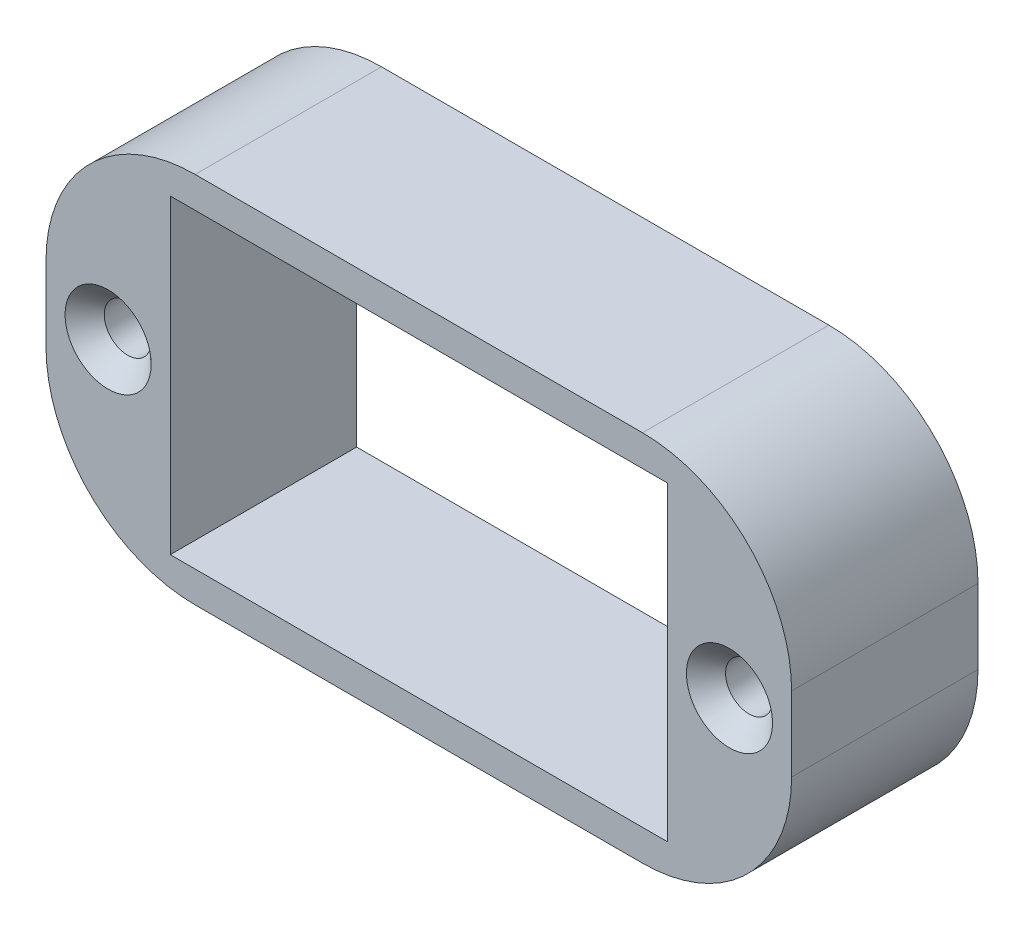
ISO-10303-21;
HEADER;
FILE_DESCRIPTION(('STEP AP214'),'2;1');
FILE_NAME('part.step','',(''),(''),'','','');
FILE_SCHEMA(('AUTOMOTIVE_DESIGN { 1 0 10303 214 1 1 1 1 }'));
ENDSEC;
DATA;
#1=APPLICATION_CONTEXT('core data for automotive mechanical design processes');
#2=APPLICATION_PROTOCOL_DEFINITION('international standard','automotive_design',2000,#1);
#3=PRODUCT_CONTEXT('',#1,'mechanical');
#4=PRODUCT('Part','Part','',(#3));
#5=PRODUCT_RELATED_PRODUCT_CATEGORY('part','',(#4));
#6=PRODUCT_DEFINITION_FORMATION('','',#4);
#7=PRODUCT_DEFINITION_CONTEXT('part definition',#1,'design');
#8=PRODUCT_DEFINITION('design','',#6,#7);
#9=PRODUCT_DEFINITION_SHAPE('','',#8);
#10=(LENGTH_UNIT() NAMED_UNIT(*) SI_UNIT(.MILLI.,.METRE.));
#11=(NAMED_UNIT(*) PLANE_ANGLE_UNIT() SI_UNIT($,.RADIAN.));
#12=(NAMED_UNIT(*) SI_UNIT($,.STERADIAN.) SOLID_ANGLE_UNIT());
#13=UNCERTAINTY_MEASURE_WITH_UNIT(LENGTH_MEASURE(1.E-05),#10,'distance_accuracy_value','');
#14=(GEOMETRIC_REPRESENTATION_CONTEXT(3) GLOBAL_UNCERTAINTY_ASSIGNED_CONTEXT((#13)) GLOBAL_UNIT_ASSIGNED_CONTEXT((#10,
#11,#12)) REPRESENTATION_CONTEXT('',''));
#15=CARTESIAN_POINT('',(0.,0.,0.));
#16=DIRECTION('',(0.,0.,1.));
#17=DIRECTION('',(1.,0.,0.));
#18=AXIS2_PLACEMENT_3D('',#15,#16,#17);
#19=CARTESIAN_POINT('',(-19.05,-9.525,9.525));
#20=DIRECTION('',(1.,0.,0.));
#21=DIRECTION('',(0.,0.,-1.));
#22=AXIS2_PLACEMENT_3D('',#19,#20,#21);
#23=PLANE('',#22);
#24=DIRECTION('',(0.,-1.,0.));
#25=VECTOR('',#24,1.);
#26=CARTESIAN_POINT('',(-19.05,-9.525,0.));
#27=LINE('',#26,#25);
#28=CARTESIAN_POINT('',(-19.05,1.905,0.));
#29=VERTEX_POINT('',#28);
#30=CARTESIAN_POINT('',(-19.05,-1.905,0.));
#31=VERTEX_POINT('',#30);
#32=EDGE_CURVE('E168',#29,#31,#27,.T.);
#33=ORIENTED_EDGE('',*,*,#32,.T.);
#34=DIRECTION('',(0.,0.,-1.));
#35=VECTOR('',#34,1.);
#36=CARTESIAN_POINT('',(-19.05,-1.905,9.525));
#37=LINE('',#36,#35);
#38=CARTESIAN_POINT('',(-19.05,-1.905,9.525));
#39=VERTEX_POINT('',#38);
#40=EDGE_CURVE('E11',#31,#39,#37,.F.);
#41=ORIENTED_EDGE('',*,*,#40,.T.);
#42=DIRECTION('',(0.,-1.,0.));
#43=VECTOR('',#42,1.);
#44=CARTESIAN_POINT('',(-19.05,-9.525,9.525));
#45=LINE('',#44,#43);
#46=CARTESIAN_POINT('',(-19.05,1.905,9.525));
#47=VERTEX_POINT('',#46);
#48=EDGE_CURVE('E172',#47,#39,#45,.T.);
#49=ORIENTED_EDGE('',*,*,#48,.F.);
#50=DIRECTION('',(0.,0.,-1.));
#51=VECTOR('',#50,1.);
#52=CARTESIAN_POINT('',(-19.05,1.905,9.525));
#53=LINE('',#52,#51);
#54=EDGE_CURVE('E43',#47,#29,#53,.T.);
#55=ORIENTED_EDGE('',*,*,#54,.T.);
#56=EDGE_LOOP('',(#33,#41,#49,#55));
#57=FACE_BOUND('',#56,.T.);
#58=ADVANCED_FACE('F35',(#57),#23,.F.);
#59=CARTESIAN_POINT('',(19.05,-9.525,9.525));
#60=DIRECTION('',(0.,1.,0.));
#61=DIRECTION('',(-1.,0.,0.));
#62=AXIS2_PLACEMENT_3D('',#59,#60,#61);
#63=PLANE('',#62);
#64=DIRECTION('',(1.,0.,0.));
#65=VECTOR('',#64,1.);
#66=CARTESIAN_POINT('',(19.05,-9.525,0.));
#67=LINE('',#66,#65);
#68=CARTESIAN_POINT('',(-11.43,-9.525,0.));
#69=VERTEX_POINT('',#68);
#70=CARTESIAN_POINT('',(11.43,-9.525,0.));
#71=VERTEX_POINT('',#70);
#72=EDGE_CURVE('E186',#69,#71,#67,.T.);
#73=ORIENTED_EDGE('',*,*,#72,.T.);
#74=DIRECTION('',(0.,0.,-1.));
#75=VECTOR('',#74,1.);
#76=CARTESIAN_POINT('',(11.43,-9.525,9.525));
#77=LINE('',#76,#75);
#78=CARTESIAN_POINT('',(11.43,-9.525,9.525));
#79=VERTEX_POINT('',#78);
#80=EDGE_CURVE('E50',#71,#79,#77,.F.);
#81=ORIENTED_EDGE('',*,*,#80,.T.);
#82=DIRECTION('',(1.,0.,0.));
#83=VECTOR('',#82,1.);
#84=CARTESIAN_POINT('',(19.05,-9.525,9.525));
#85=LINE('',#84,#83);
#86=CARTESIAN_POINT('',(-11.43,-9.525,9.525));
#87=VERTEX_POINT('',#86);
#88=EDGE_CURVE('E174',#87,#79,#85,.T.);
#89=ORIENTED_EDGE('',*,*,#88,.F.);
#90=DIRECTION('',(0.,0.,-1.));
#91=VECTOR('',#90,1.);
#92=CARTESIAN_POINT('',(-11.43,-9.525,9.525));
#93=LINE('',#92,#91);
#94=EDGE_CURVE('E217',#87,#69,#93,.T.);
#95=ORIENTED_EDGE('',*,*,#94,.T.);
#96=EDGE_LOOP('',(#73,#81,#89,#95));
#97=FACE_BOUND('',#96,.T.);
#98=ADVANCED_FACE('F233',(#97),#63,.F.);
#99=CARTESIAN_POINT('',(19.05,-9.525,9.525));
#100=DIRECTION('',(-1.,0.,0.));
#101=DIRECTION('',(0.,0.,1.));
#102=AXIS2_PLACEMENT_3D('',#99,#100,#101);
#103=PLANE('',#102);
#104=DIRECTION('',(0.,1.,0.));
#105=VECTOR('',#104,1.);
#106=CARTESIAN_POINT('',(19.05,-9.525,0.));
#107=LINE('',#106,#105);
#108=CARTESIAN_POINT('',(19.05,-1.905,0.));
#109=VERTEX_POINT('',#108);
#110=CARTESIAN_POINT('',(19.05,1.905,0.));
#111=VERTEX_POINT('',#110);
#112=EDGE_CURVE('E188',#109,#111,#107,.T.);
#113=ORIENTED_EDGE('',*,*,#112,.T.);
#114=DIRECTION('',(0.,0.,-1.));
#115=VECTOR('',#114,1.);
#116=CARTESIAN_POINT('',(19.05,1.905,9.525));
#117=LINE('',#116,#115);
#118=CARTESIAN_POINT('',(19.05,1.905,9.525));
#119=VERTEX_POINT('',#118);
#120=EDGE_CURVE('E208',#111,#119,#117,.F.);
#121=ORIENTED_EDGE('',*,*,#120,.T.);
#122=DIRECTION('',(0.,1.,0.));
#123=VECTOR('',#122,1.);
#124=CARTESIAN_POINT('',(19.05,-9.525,9.525));
#125=LINE('',#124,#123);
#126=CARTESIAN_POINT('',(19.05,-1.905,9.525));
#127=VERTEX_POINT('',#126);
#128=EDGE_CURVE('E177',#127,#119,#125,.T.);
#129=ORIENTED_EDGE('',*,*,#128,.F.);
#130=DIRECTION('',(0.,0.,-1.));
#131=VECTOR('',#130,1.);
#132=CARTESIAN_POINT('',(19.05,-1.905,9.525));
#133=LINE('',#132,#131);
#134=EDGE_CURVE('E205',#127,#109,#133,.T.);
#135=ORIENTED_EDGE('',*,*,#134,.T.);
#136=EDGE_LOOP('',(#113,#121,#129,#135));
#137=FACE_BOUND('',#136,.T.);
#138=ADVANCED_FACE('F242',(#137),#103,.F.);
#139=CARTESIAN_POINT('',(19.05,9.525,9.525));
#140=DIRECTION('',(0.,-1.,0.));
#141=DIRECTION('',(1.,0.,0.));
#142=AXIS2_PLACEMENT_3D('',#139,#140,#141);
#143=PLANE('',#142);
#144=DIRECTION('',(-1.,0.,0.));
#145=VECTOR('',#144,1.);
#146=CARTESIAN_POINT('',(19.05,9.525,9.525));
#147=LINE('',#146,#145);
#148=CARTESIAN_POINT('',(11.43,9.525,9.525));
#149=VERTEX_POINT('',#148);
#150=CARTESIAN_POINT('',(-11.43,9.525,9.525));
#151=VERTEX_POINT('',#150);
#152=EDGE_CURVE('E180',#149,#151,#147,.T.);
#153=ORIENTED_EDGE('',*,*,#152,.F.);
#154=DIRECTION('',(0.,0.,-1.));
#155=VECTOR('',#154,1.);
#156=CARTESIAN_POINT('',(11.43,9.525,9.525));
#157=LINE('',#156,#155);
#158=CARTESIAN_POINT('',(11.43,9.525,0.));
#159=VERTEX_POINT('',#158);
#160=EDGE_CURVE('E194',#149,#159,#157,.T.);
#161=ORIENTED_EDGE('',*,*,#160,.T.);
#162=DIRECTION('',(-1.,0.,0.));
#163=VECTOR('',#162,1.);
#164=CARTESIAN_POINT('',(19.05,9.525,0.));
#165=LINE('',#164,#163);
#166=CARTESIAN_POINT('',(-11.43,9.525,0.));
#167=VERTEX_POINT('',#166);
#168=EDGE_CURVE('E175',#159,#167,#165,.T.);
#169=ORIENTED_EDGE('',*,*,#168,.T.);
#170=DIRECTION('',(0.,0.,-1.));
#171=VECTOR('',#170,1.);
#172=CARTESIAN_POINT('',(-11.43,9.525,9.525));
#173=LINE('',#172,#171);
#174=EDGE_CURVE('E183',#167,#151,#173,.F.);
#175=ORIENTED_EDGE('',*,*,#174,.T.);
#176=EDGE_LOOP('',(#153,#161,#169,#175));
#177=FACE_BOUND('',#176,.T.);
#178=ADVANCED_FACE('F250',(#177),#143,.F.);
#179=CARTESIAN_POINT('',(0.,0.,9.525));
#180=DIRECTION('',(0.,0.,1.));
#181=DIRECTION('',(1.,0.,0.));
#182=AXIS2_PLACEMENT_3D('',#179,#180,#181);
#183=PLANE('',#182);
#184=CARTESIAN_POINT('',(-15.875,0.,9.525));
#185=DIRECTION('',(0.,0.,1.));
#186=DIRECTION('',(1.,0.,0.));
#187=AXIS2_PLACEMENT_3D('',#184,#185,#186);
#188=CIRCLE('',#187,2.2);
#189=CARTESIAN_POINT('',(-13.675,0.,9.525));
#190=VERTEX_POINT('',#189);
#191=EDGE_CURVE('E419',#190,#190,#188,.T.);
#192=ORIENTED_EDGE('',*,*,#191,.F.);
#193=EDGE_LOOP('',(#192));
#194=FACE_BOUND('',#193,.T.);
#195=CARTESIAN_POINT('',(15.875,0.,9.525));
#196=DIRECTION('',(0.,0.,1.));
#197=DIRECTION('',(1.,0.,0.));
#198=AXIS2_PLACEMENT_3D('',#195,#196,#197);
#199=CIRCLE('',#198,2.2);
#200=CARTESIAN_POINT('',(18.075,0.,9.525));
#201=VERTEX_POINT('',#200);
#202=EDGE_CURVE('E426',#201,#201,#199,.T.);
#203=ORIENTED_EDGE('',*,*,#202,.F.);
#204=EDGE_LOOP('',(#203));
#205=FACE_BOUND('',#204,.T.);
#206=DIRECTION('',(0.,-1.,0.));
#207=VECTOR('',#206,1.);
#208=CARTESIAN_POINT('',(-12.7,-7.9375,9.525));
#209=LINE('',#208,#207);
#210=CARTESIAN_POINT('',(-12.7,7.9375,9.525));
#211=VERTEX_POINT('',#210);
#212=CARTESIAN_POINT('',(-12.7,-7.9375,9.525));
#213=VERTEX_POINT('',#212);
#214=EDGE_CURVE('E132',#211,#213,#209,.T.);
#215=ORIENTED_EDGE('',*,*,#214,.F.);
#216=DIRECTION('',(-1.,0.,0.));
#217=VECTOR('',#216,1.);
#218=CARTESIAN_POINT('',(12.7,7.93750000000001,9.525));
#219=LINE('',#218,#217);
#220=CARTESIAN_POINT('',(12.7,7.93750000000001,9.525));
#221=VERTEX_POINT('',#220);
#222=EDGE_CURVE('E150',#221,#211,#219,.T.);
#223=ORIENTED_EDGE('',*,*,#222,.F.);
#224=DIRECTION('',(0.,1.,0.));
#225=VECTOR('',#224,1.);
#226=CARTESIAN_POINT('',(12.7,-7.9375,9.525));
#227=LINE('',#226,#225);
#228=CARTESIAN_POINT('',(12.7,-7.9375,9.525));
#229=VERTEX_POINT('',#228);
#230=EDGE_CURVE('E153',#229,#221,#227,.T.);
#231=ORIENTED_EDGE('',*,*,#230,.F.);
#232=DIRECTION('',(1.,0.,0.));
#233=VECTOR('',#232,1.);
#234=CARTESIAN_POINT('',(12.7,-7.9375,9.525));
#235=LINE('',#234,#233);
#236=EDGE_CURVE('E162',#213,#229,#235,.T.);
#237=ORIENTED_EDGE('',*,*,#236,.F.);
#238=EDGE_LOOP('',(#215,#223,#231,#237));
#239=FACE_BOUND('',#238,.T.);
#240=ORIENTED_EDGE('',*,*,#128,.T.);
#241=CARTESIAN_POINT('',(11.43,1.905,9.525));
#242=DIRECTION('',(0.,0.,1.));
#243=DIRECTION('',(1.,0.,0.));
#244=AXIS2_PLACEMENT_3D('',#241,#242,#243);
#245=CIRCLE('',#244,7.62);
#246=EDGE_CURVE('E215',#119,#149,#245,.T.);
#247=ORIENTED_EDGE('',*,*,#246,.T.);
#248=ORIENTED_EDGE('',*,*,#152,.T.);
#249=CARTESIAN_POINT('',(-11.43,1.905,9.525));
#250=DIRECTION('',(0.,0.,1.));
#251=DIRECTION('',(1.,0.,0.));
#252=AXIS2_PLACEMENT_3D('',#249,#250,#251);
#253=CIRCLE('',#252,7.62);
#254=EDGE_CURVE('E210',#151,#47,#253,.T.);
#255=ORIENTED_EDGE('',*,*,#254,.T.);
#256=ORIENTED_EDGE('',*,*,#48,.T.);
#257=CARTESIAN_POINT('',(-11.43,-1.905,9.525));
#258=DIRECTION('',(0.,0.,1.));
#259=DIRECTION('',(1.,0.,0.));
#260=AXIS2_PLACEMENT_3D('',#257,#258,#259);
#261=CIRCLE('',#260,7.62);
#262=EDGE_CURVE('E57',#39,#87,#261,.T.);
#263=ORIENTED_EDGE('',*,*,#262,.T.);
#264=ORIENTED_EDGE('',*,*,#88,.T.);
#265=CARTESIAN_POINT('',(11.43,-1.905,9.525));
#266=DIRECTION('',(0.,0.,1.));
#267=DIRECTION('',(1.,0.,0.));
#268=AXIS2_PLACEMENT_3D('',#265,#266,#267);
#269=CIRCLE('',#268,7.62);
#270=EDGE_CURVE('E213',#79,#127,#269,.T.);
#271=ORIENTED_EDGE('',*,*,#270,.T.);
#272=EDGE_LOOP('',(#240,#247,#248,#255,#256,#263,#264,#271));
#273=FACE_BOUND('',#272,.T.);
#274=ADVANCED_FACE('F235',(#194,#205,#239,#273),#183,.T.);
#275=CARTESIAN_POINT('',(0.,0.,0.));
#276=DIRECTION('',(0.,0.,1.));
#277=DIRECTION('',(1.,0.,0.));
#278=AXIS2_PLACEMENT_3D('',#275,#276,#277);
#279=PLANE('',#278);
#280=CARTESIAN_POINT('',(-15.875,0.,0.));
#281=DIRECTION('',(0.,0.,1.));
#282=DIRECTION('',(1.,0.,0.));
#283=AXIS2_PLACEMENT_3D('',#280,#281,#282);
#284=CIRCLE('',#283,1.2);
#285=CARTESIAN_POINT('',(-14.675,0.,0.));
#286=VERTEX_POINT('',#285);
#287=EDGE_CURVE('E421',#286,#286,#284,.T.);
#288=ORIENTED_EDGE('',*,*,#287,.T.);
#289=EDGE_LOOP('',(#288));
#290=FACE_BOUND('',#289,.T.);
#291=CARTESIAN_POINT('',(15.875,0.,0.));
#292=DIRECTION('',(0.,0.,1.));
#293=DIRECTION('',(1.,0.,0.));
#294=AXIS2_PLACEMENT_3D('',#291,#292,#293);
#295=CIRCLE('',#294,1.2);
#296=CARTESIAN_POINT('',(17.075,0.,0.));
#297=VERTEX_POINT('',#296);
#298=EDGE_CURVE('E156',#297,#297,#295,.T.);
#299=ORIENTED_EDGE('',*,*,#298,.T.);
#300=EDGE_LOOP('',(#299));
#301=FACE_BOUND('',#300,.T.);
#302=DIRECTION('',(-1.,0.,0.));
#303=VECTOR('',#302,1.);
#304=CARTESIAN_POINT('',(12.7,7.93750000000001,0.));
#305=LINE('',#304,#303);
#306=CARTESIAN_POINT('',(12.7,7.93750000000001,0.));
#307=VERTEX_POINT('',#306);
#308=CARTESIAN_POINT('',(-12.7,7.9375,0.));
#309=VERTEX_POINT('',#308);
#310=EDGE_CURVE('E137',#307,#309,#305,.T.);
#311=ORIENTED_EDGE('',*,*,#310,.T.);
#312=DIRECTION('',(0.,-1.,0.));
#313=VECTOR('',#312,1.);
#314=CARTESIAN_POINT('',(-12.7,-7.9375,0.));
#315=LINE('',#314,#313);
#316=CARTESIAN_POINT('',(-12.7,-7.9375,0.));
#317=VERTEX_POINT('',#316);
#318=EDGE_CURVE('E129',#309,#317,#315,.T.);
#319=ORIENTED_EDGE('',*,*,#318,.T.);
#320=DIRECTION('',(1.,0.,0.));
#321=VECTOR('',#320,1.);
#322=CARTESIAN_POINT('',(12.7,-7.9375,0.));
#323=LINE('',#322,#321);
#324=CARTESIAN_POINT('',(12.7,-7.9375,0.));
#325=VERTEX_POINT('',#324);
#326=EDGE_CURVE('E141',#317,#325,#323,.T.);
#327=ORIENTED_EDGE('',*,*,#326,.T.);
#328=DIRECTION('',(0.,1.,0.));
#329=VECTOR('',#328,1.);
#330=CARTESIAN_POINT('',(12.7,-7.9375,0.));
#331=LINE('',#330,#329);
#332=EDGE_CURVE('E145',#325,#307,#331,.T.);
#333=ORIENTED_EDGE('',*,*,#332,.T.);
#334=EDGE_LOOP('',(#311,#319,#327,#333));
#335=FACE_BOUND('',#334,.T.);
#336=ORIENTED_EDGE('',*,*,#168,.F.);
#337=CARTESIAN_POINT('',(11.43,1.905,0.));
#338=DIRECTION('',(0.,0.,1.));
#339=DIRECTION('',(1.,0.,0.));
#340=AXIS2_PLACEMENT_3D('',#337,#338,#339);
#341=CIRCLE('',#340,7.62);
#342=EDGE_CURVE('E203',#159,#111,#341,.F.);
#343=ORIENTED_EDGE('',*,*,#342,.T.);
#344=ORIENTED_EDGE('',*,*,#112,.F.);
#345=CARTESIAN_POINT('',(11.43,-1.905,0.));
#346=DIRECTION('',(0.,0.,1.));
#347=DIRECTION('',(1.,0.,0.));
#348=AXIS2_PLACEMENT_3D('',#345,#346,#347);
#349=CIRCLE('',#348,7.62);
#350=EDGE_CURVE('E201',#109,#71,#349,.F.);
#351=ORIENTED_EDGE('',*,*,#350,.T.);
#352=ORIENTED_EDGE('',*,*,#72,.F.);
#353=CARTESIAN_POINT('',(-11.43,-1.905,0.));
#354=DIRECTION('',(0.,0.,1.));
#355=DIRECTION('',(1.,0.,0.));
#356=AXIS2_PLACEMENT_3D('',#353,#354,#355);
#357=CIRCLE('',#356,7.62);
#358=EDGE_CURVE('E199',#69,#31,#357,.F.);
#359=ORIENTED_EDGE('',*,*,#358,.T.);
#360=ORIENTED_EDGE('',*,*,#32,.F.);
#361=CARTESIAN_POINT('',(-11.43,1.905,0.));
#362=DIRECTION('',(0.,0.,1.));
#363=DIRECTION('',(1.,0.,0.));
#364=AXIS2_PLACEMENT_3D('',#361,#362,#363);
#365=CIRCLE('',#364,7.62);
#366=EDGE_CURVE('E197',#29,#167,#365,.F.);
#367=ORIENTED_EDGE('',*,*,#366,.T.);
#368=EDGE_LOOP('',(#336,#343,#344,#351,#352,#359,#360,#367));
#369=FACE_BOUND('',#368,.T.);
#370=ADVANCED_FACE('F147',(#290,#301,#335,#369),#279,.F.);
#371=CARTESIAN_POINT('',(-12.7,-7.9375,0.));
#372=DIRECTION('',(-1.,0.,0.));
#373=DIRECTION('',(0.,0.,1.));
#374=AXIS2_PLACEMENT_3D('',#371,#372,#373);
#375=PLANE('',#374);
#376=ORIENTED_EDGE('',*,*,#214,.T.);
#377=DIRECTION('',(0.,0.,1.));
#378=VECTOR('',#377,1.);
#379=CARTESIAN_POINT('',(-12.7,-7.9375,0.));
#380=LINE('',#379,#378);
#381=EDGE_CURVE('E125',#317,#213,#380,.T.);
#382=ORIENTED_EDGE('',*,*,#381,.F.);
#383=ORIENTED_EDGE('',*,*,#318,.F.);
#384=DIRECTION('',(0.,0.,1.));
#385=VECTOR('',#384,1.);
#386=CARTESIAN_POINT('',(-12.7,7.9375,0.));
#387=LINE('',#386,#385);
#388=EDGE_CURVE('E166',#309,#211,#387,.T.);
#389=ORIENTED_EDGE('',*,*,#388,.T.);
#390=EDGE_LOOP('',(#376,#382,#383,#389));
#391=FACE_BOUND('',#390,.T.);
#392=ADVANCED_FACE('F127',(#391),#375,.F.);
#393=CARTESIAN_POINT('',(12.7,7.93750000000001,0.));
#394=DIRECTION('',(0.,1.,0.));
#395=DIRECTION('',(-1.,0.,0.));
#396=AXIS2_PLACEMENT_3D('',#393,#394,#395);
#397=PLANE('',#396);
#398=ORIENTED_EDGE('',*,*,#222,.T.);
#399=ORIENTED_EDGE('',*,*,#388,.F.);
#400=ORIENTED_EDGE('',*,*,#310,.F.);
#401=DIRECTION('',(0.,0.,1.));
#402=VECTOR('',#401,1.);
#403=CARTESIAN_POINT('',(12.7,7.93750000000001,0.));
#404=LINE('',#403,#402);
#405=EDGE_CURVE('E169',#307,#221,#404,.T.);
#406=ORIENTED_EDGE('',*,*,#405,.T.);
#407=EDGE_LOOP('',(#398,#399,#400,#406));
#408=FACE_BOUND('',#407,.T.);
#409=ADVANCED_FACE('F349',(#408),#397,.F.);
#410=CARTESIAN_POINT('',(12.7,-7.9375,0.));
#411=DIRECTION('',(1.,0.,0.));
#412=DIRECTION('',(0.,0.,-1.));
#413=AXIS2_PLACEMENT_3D('',#410,#411,#412);
#414=PLANE('',#413);
#415=ORIENTED_EDGE('',*,*,#230,.T.);
#416=ORIENTED_EDGE('',*,*,#405,.F.);
#417=ORIENTED_EDGE('',*,*,#332,.F.);
#418=DIRECTION('',(0.,0.,1.));
#419=VECTOR('',#418,1.);
#420=CARTESIAN_POINT('',(12.7,-7.9375,0.));
#421=LINE('',#420,#419);
#422=EDGE_CURVE('E136',#325,#229,#421,.T.);
#423=ORIENTED_EDGE('',*,*,#422,.T.);
#424=EDGE_LOOP('',(#415,#416,#417,#423));
#425=FACE_BOUND('',#424,.T.);
#426=ADVANCED_FACE('F352',(#425),#414,.F.);
#427=CARTESIAN_POINT('',(12.7,-7.9375,0.));
#428=DIRECTION('',(0.,-1.,0.));
#429=DIRECTION('',(1.,0.,0.));
#430=AXIS2_PLACEMENT_3D('',#427,#428,#429);
#431=PLANE('',#430);
#432=ORIENTED_EDGE('',*,*,#236,.T.);
#433=ORIENTED_EDGE('',*,*,#422,.F.);
#434=ORIENTED_EDGE('',*,*,#326,.F.);
#435=ORIENTED_EDGE('',*,*,#381,.T.);
#436=EDGE_LOOP('',(#432,#433,#434,#435));
#437=FACE_BOUND('',#436,.T.);
#438=ADVANCED_FACE('F142',(#437),#431,.F.);
#439=CARTESIAN_POINT('',(11.43,1.905,9.525));
#440=DIRECTION('',(0.,0.,-1.));
#441=DIRECTION('',(-1.,0.,0.));
#442=AXIS2_PLACEMENT_3D('',#439,#440,#441);
#443=CYLINDRICAL_SURFACE('',#442,7.62);
#444=ORIENTED_EDGE('',*,*,#246,.F.);
#445=ORIENTED_EDGE('',*,*,#120,.F.);
#446=ORIENTED_EDGE('',*,*,#342,.F.);
#447=ORIENTED_EDGE('',*,*,#160,.F.);
#448=EDGE_LOOP('',(#444,#445,#446,#447));
#449=FACE_BOUND('',#448,.T.);
#450=ADVANCED_FACE('F247',(#449),#443,.T.);
#451=CARTESIAN_POINT('',(11.43,-1.905,9.525));
#452=DIRECTION('',(0.,0.,-1.));
#453=DIRECTION('',(-1.,0.,0.));
#454=AXIS2_PLACEMENT_3D('',#451,#452,#453);
#455=CYLINDRICAL_SURFACE('',#454,7.62);
#456=ORIENTED_EDGE('',*,*,#270,.F.);
#457=ORIENTED_EDGE('',*,*,#80,.F.);
#458=ORIENTED_EDGE('',*,*,#350,.F.);
#459=ORIENTED_EDGE('',*,*,#134,.F.);
#460=EDGE_LOOP('',(#456,#457,#458,#459));
#461=FACE_BOUND('',#460,.T.);
#462=ADVANCED_FACE('F239',(#461),#455,.T.);
#463=CARTESIAN_POINT('',(-11.43,-1.905,9.525));
#464=DIRECTION('',(0.,0.,-1.));
#465=DIRECTION('',(-1.,0.,0.));
#466=AXIS2_PLACEMENT_3D('',#463,#464,#465);
#467=CYLINDRICAL_SURFACE('',#466,7.62);
#468=ORIENTED_EDGE('',*,*,#262,.F.);
#469=ORIENTED_EDGE('',*,*,#40,.F.);
#470=ORIENTED_EDGE('',*,*,#358,.F.);
#471=ORIENTED_EDGE('',*,*,#94,.F.);
#472=EDGE_LOOP('',(#468,#469,#470,#471));
#473=FACE_BOUND('',#472,.T.);
#474=ADVANCED_FACE('F232',(#473),#467,.T.);
#475=CARTESIAN_POINT('',(-11.43,1.905,9.525));
#476=DIRECTION('',(0.,0.,-1.));
#477=DIRECTION('',(-1.,0.,0.));
#478=AXIS2_PLACEMENT_3D('',#475,#476,#477);
#479=CYLINDRICAL_SURFACE('',#478,7.62);
#480=ORIENTED_EDGE('',*,*,#254,.F.);
#481=ORIENTED_EDGE('',*,*,#174,.F.);
#482=ORIENTED_EDGE('',*,*,#366,.F.);
#483=ORIENTED_EDGE('',*,*,#54,.F.);
#484=EDGE_LOOP('',(#480,#481,#482,#483));
#485=FACE_BOUND('',#484,.T.);
#486=ADVANCED_FACE('F37',(#485),#479,.T.);
#487=CARTESIAN_POINT('',(15.875,0.,9.525));
#488=DIRECTION('',(0.,0.,1.));
#489=DIRECTION('',(1.,0.,0.));
#490=AXIS2_PLACEMENT_3D('',#487,#488,#489);
#491=CYLINDRICAL_SURFACE('',#490,1.2);
#492=ORIENTED_EDGE('',*,*,#298,.F.);
#493=EDGE_LOOP('',(#492));
#494=FACE_BOUND('',#493,.T.);
#495=CARTESIAN_POINT('',(15.875,0.,8.525));
#496=DIRECTION('',(0.,0.,1.));
#497=DIRECTION('',(1.,0.,0.));
#498=AXIS2_PLACEMENT_3D('',#495,#496,#497);
#499=CIRCLE('',#498,1.2);
#500=CARTESIAN_POINT('',(17.075,0.,8.525));
#501=VERTEX_POINT('',#500);
#502=EDGE_CURVE('E428',#501,#501,#499,.T.);
#503=ORIENTED_EDGE('',*,*,#502,.T.);
#504=EDGE_LOOP('',(#503));
#505=FACE_BOUND('',#504,.T.);
#506=ADVANCED_FACE('F253',(#494,#505),#491,.F.);
#507=CARTESIAN_POINT('',(15.875,0.,9.525));
#508=DIRECTION('',(0.,0.,1.));
#509=DIRECTION('',(1.,0.,0.));
#510=AXIS2_PLACEMENT_3D('',#507,#508,#509);
#511=CONICAL_SURFACE('',#510,2.2,0.785398163397448);
#512=ORIENTED_EDGE('',*,*,#502,.F.);
#513=EDGE_LOOP('',(#512));
#514=FACE_BOUND('',#513,.T.);
#515=ORIENTED_EDGE('',*,*,#202,.T.);
#516=EDGE_LOOP('',(#515));
#517=FACE_BOUND('',#516,.T.);
#518=ADVANCED_FACE('F258',(#514,#517),#511,.F.);
#519=CARTESIAN_POINT('',(-15.875,0.,9.525));
#520=DIRECTION('',(0.,0.,1.));
#521=DIRECTION('',(1.,0.,0.));
#522=AXIS2_PLACEMENT_3D('',#519,#520,#521);
#523=CYLINDRICAL_SURFACE('',#522,1.2);
#524=ORIENTED_EDGE('',*,*,#287,.F.);
#525=EDGE_LOOP('',(#524));
#526=FACE_BOUND('',#525,.T.);
#527=CARTESIAN_POINT('',(-15.875,0.,8.525));
#528=DIRECTION('',(0.,0.,1.));
#529=DIRECTION('',(1.,0.,0.));
#530=AXIS2_PLACEMENT_3D('',#527,#528,#529);
#531=CIRCLE('',#530,1.2);
#532=CARTESIAN_POINT('',(-14.675,0.,8.525));
#533=VERTEX_POINT('',#532);
#534=EDGE_CURVE('E416',#533,#533,#531,.T.);
#535=ORIENTED_EDGE('',*,*,#534,.T.);
#536=EDGE_LOOP('',(#535));
#537=FACE_BOUND('',#536,.T.);
#538=ADVANCED_FACE('F322',(#526,#537),#523,.F.);
#539=CARTESIAN_POINT('',(-15.875,0.,9.525));
#540=DIRECTION('',(0.,0.,1.));
#541=DIRECTION('',(1.,0.,0.));
#542=AXIS2_PLACEMENT_3D('',#539,#540,#541);
#543=CONICAL_SURFACE('',#542,2.2,0.785398163397449);
#544=ORIENTED_EDGE('',*,*,#534,.F.);
#545=EDGE_LOOP('',(#544));
#546=FACE_BOUND('',#545,.T.);
#547=ORIENTED_EDGE('',*,*,#191,.T.);
#548=EDGE_LOOP('',(#547));
#549=FACE_BOUND('',#548,.T.);
#550=ADVANCED_FACE('F332',(#546,#549),#543,.F.);
#551=CLOSED_SHELL('',(#58,#98,#138,#178,#274,#370,#392,#409,#426,#438,#450,#462,#474,#486,#506,
#518,#538,#550));
#552=MANIFOLD_SOLID_BREP('B2',#551);
#553=ADVANCED_BREP_SHAPE_REPRESENTATION('',(#18,#552),#14);
#554=SHAPE_DEFINITION_REPRESENTATION(#9,#553);
ENDSEC;
END-ISO-10303-21;
